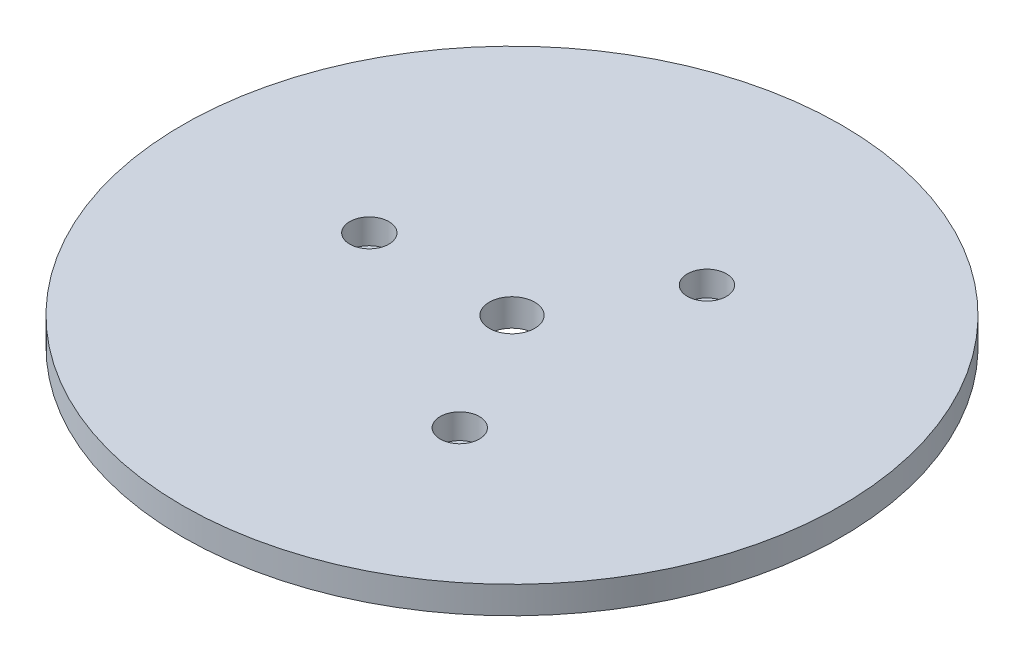
ISO-10303-21;
HEADER;
FILE_DESCRIPTION(('STEP AP214'),'2;1');
FILE_NAME('part.step','',(''),(''),'','','');
FILE_SCHEMA(('AUTOMOTIVE_DESIGN { 1 0 10303 214 1 1 1 1 }'));
ENDSEC;
DATA;
#1=APPLICATION_CONTEXT('core data for automotive mechanical design processes');
#2=APPLICATION_PROTOCOL_DEFINITION('international standard','automotive_design',2000,#1);
#3=PRODUCT_CONTEXT('',#1,'mechanical');
#4=PRODUCT('Part','Part','',(#3));
#5=PRODUCT_RELATED_PRODUCT_CATEGORY('part','',(#4));
#6=PRODUCT_DEFINITION_FORMATION('','',#4);
#7=PRODUCT_DEFINITION_CONTEXT('part definition',#1,'design');
#8=PRODUCT_DEFINITION('design','',#6,#7);
#9=PRODUCT_DEFINITION_SHAPE('','',#8);
#10=(LENGTH_UNIT() NAMED_UNIT(*) SI_UNIT(.MILLI.,.METRE.));
#11=(NAMED_UNIT(*) PLANE_ANGLE_UNIT() SI_UNIT($,.RADIAN.));
#12=(NAMED_UNIT(*) SI_UNIT($,.STERADIAN.) SOLID_ANGLE_UNIT());
#13=UNCERTAINTY_MEASURE_WITH_UNIT(LENGTH_MEASURE(1.E-05),#10,'distance_accuracy_value','');
#14=(GEOMETRIC_REPRESENTATION_CONTEXT(3) GLOBAL_UNCERTAINTY_ASSIGNED_CONTEXT((#13)) GLOBAL_UNIT_ASSIGNED_CONTEXT((#10,
#11,#12)) REPRESENTATION_CONTEXT('',''));
#15=CARTESIAN_POINT('',(0.,0.,0.));
#16=DIRECTION('',(0.,0.,1.));
#17=DIRECTION('',(1.,0.,0.));
#18=AXIS2_PLACEMENT_3D('',#15,#16,#17);
#19=CARTESIAN_POINT('',(0.,6.,0.));
#20=DIRECTION('',(0.,-1.,0.));
#21=DIRECTION('',(0.,0.,-1.));
#22=AXIS2_PLACEMENT_3D('',#19,#20,#21);
#23=CYLINDRICAL_SURFACE('',#22,72.5);
#24=CARTESIAN_POINT('',(0.,6.,0.));
#25=DIRECTION('',(0.,1.,0.));
#26=DIRECTION('',(0.,0.,1.));
#27=AXIS2_PLACEMENT_3D('',#24,#25,#26);
#28=CIRCLE('',#27,72.5);
#29=CARTESIAN_POINT('',(0.,6.,72.5));
#30=VERTEX_POINT('',#29);
#31=EDGE_CURVE('E10',#30,#30,#28,.T.);
#32=ORIENTED_EDGE('',*,*,#31,.F.);
#33=EDGE_LOOP('',(#32));
#34=FACE_BOUND('',#33,.T.);
#35=CARTESIAN_POINT('',(0.,0.,0.));
#36=DIRECTION('',(0.,1.,0.));
#37=DIRECTION('',(0.,0.,1.));
#38=AXIS2_PLACEMENT_3D('',#35,#36,#37);
#39=CIRCLE('',#38,72.5);
#40=CARTESIAN_POINT('',(0.,0.,72.5));
#41=VERTEX_POINT('',#40);
#42=EDGE_CURVE('E37',#41,#41,#39,.T.);
#43=ORIENTED_EDGE('',*,*,#42,.T.);
#44=EDGE_LOOP('',(#43));
#45=FACE_BOUND('',#44,.T.);
#46=ADVANCED_FACE('F40',(#34,#45),#23,.T.);
#47=CARTESIAN_POINT('',(0.,6.,0.));
#48=DIRECTION('',(0.,1.,0.));
#49=DIRECTION('',(0.,0.,1.));
#50=AXIS2_PLACEMENT_3D('',#47,#48,#49);
#51=PLANE('',#50);
#52=CARTESIAN_POINT('',(15.6957823254746,6.,27.1858924522633));
#53=DIRECTION('',(0.,1.,0.));
#54=DIRECTION('',(0.866025403784436,0.,-0.500000000000004));
#55=AXIS2_PLACEMENT_3D('',#52,#53,#54);
#56=CIRCLE('',#55,4.30834410628104);
#57=CARTESIAN_POINT('',(19.4269177697589,6.,25.0317203991227));
#58=VERTEX_POINT('',#57);
#59=EDGE_CURVE('E70',#58,#58,#56,.T.);
#60=ORIENTED_EDGE('',*,*,#59,.F.);
#61=EDGE_LOOP('',(#60));
#62=FACE_BOUND('',#61,.T.);
#63=CARTESIAN_POINT('',(15.6957823254742,6.,-27.1858924522635));
#64=DIRECTION('',(0.,1.,0.));
#65=DIRECTION('',(-0.866025403784443,0.,-0.499999999999992));
#66=AXIS2_PLACEMENT_3D('',#63,#64,#65);
#67=CIRCLE('',#66,4.30834410628104);
#68=CARTESIAN_POINT('',(11.9646468811898,6.,-29.340064505404));
#69=VERTEX_POINT('',#68);
#70=EDGE_CURVE('E61',#69,#69,#67,.T.);
#71=ORIENTED_EDGE('',*,*,#70,.F.);
#72=EDGE_LOOP('',(#71));
#73=FACE_BOUND('',#72,.T.);
#74=CARTESIAN_POINT('',(-31.3915646509489,6.,0.));
#75=DIRECTION('',(0.,1.,0.));
#76=DIRECTION('',(0.,0.,1.));
#77=AXIS2_PLACEMENT_3D('',#74,#75,#76);
#78=CIRCLE('',#77,4.30834410628104);
#79=CARTESIAN_POINT('',(-31.3915646509489,6.,4.30834410628104));
#80=VERTEX_POINT('',#79);
#81=EDGE_CURVE('E54',#80,#80,#78,.T.);
#82=ORIENTED_EDGE('',*,*,#81,.F.);
#83=EDGE_LOOP('',(#82));
#84=FACE_BOUND('',#83,.T.);
#85=CARTESIAN_POINT('',(0.,6.,0.));
#86=DIRECTION('',(0.,1.,0.));
#87=DIRECTION('',(0.,0.,1.));
#88=AXIS2_PLACEMENT_3D('',#85,#86,#87);
#89=CIRCLE('',#88,5.);
#90=CARTESIAN_POINT('',(0.,6.,5.));
#91=VERTEX_POINT('',#90);
#92=EDGE_CURVE('E50',#91,#91,#89,.T.);
#93=ORIENTED_EDGE('',*,*,#92,.F.);
#94=EDGE_LOOP('',(#93));
#95=FACE_BOUND('',#94,.T.);
#96=ORIENTED_EDGE('',*,*,#31,.T.);
#97=EDGE_LOOP('',(#96));
#98=FACE_BOUND('',#97,.T.);
#99=ADVANCED_FACE('F85',(#62,#73,#84,#95,#98),#51,.T.);
#100=CARTESIAN_POINT('',(0.,0.,0.));
#101=DIRECTION('',(0.,1.,0.));
#102=DIRECTION('',(0.,0.,1.));
#103=AXIS2_PLACEMENT_3D('',#100,#101,#102);
#104=PLANE('',#103);
#105=CARTESIAN_POINT('',(0.,0.,0.));
#106=DIRECTION('',(0.,1.,0.));
#107=DIRECTION('',(0.,0.,1.));
#108=AXIS2_PLACEMENT_3D('',#105,#106,#107);
#109=CIRCLE('',#108,5.);
#110=CARTESIAN_POINT('',(0.,0.,5.));
#111=VERTEX_POINT('',#110);
#112=EDGE_CURVE('E47',#111,#111,#109,.T.);
#113=ORIENTED_EDGE('',*,*,#112,.T.);
#114=EDGE_LOOP('',(#113));
#115=FACE_BOUND('',#114,.T.);
#116=ORIENTED_EDGE('',*,*,#42,.F.);
#117=EDGE_LOOP('',(#116));
#118=FACE_BOUND('',#117,.T.);
#119=ADVANCED_FACE('F84',(#115,#118),#104,.F.);
#120=CARTESIAN_POINT('',(0.,6.,0.));
#121=DIRECTION('',(0.,-1.,0.));
#122=DIRECTION('',(0.,0.,-1.));
#123=AXIS2_PLACEMENT_3D('',#120,#121,#122);
#124=CYLINDRICAL_SURFACE('',#123,5.);
#125=ORIENTED_EDGE('',*,*,#92,.T.);
#126=EDGE_LOOP('',(#125));
#127=FACE_BOUND('',#126,.T.);
#128=ORIENTED_EDGE('',*,*,#112,.F.);
#129=EDGE_LOOP('',(#128));
#130=FACE_BOUND('',#129,.T.);
#131=ADVANCED_FACE('F91',(#127,#130),#124,.F.);
#132=CARTESIAN_POINT('',(-31.3915646509489,0.508905277982088,0.));
#133=DIRECTION('',(0.,1.,0.));
#134=DIRECTION('',(0.,0.,1.));
#135=AXIS2_PLACEMENT_3D('',#132,#133,#134);
#136=CYLINDRICAL_SURFACE('',#135,4.30834410628104);
#137=CARTESIAN_POINT('',(-31.3915646509489,0.508905277982088,0.));
#138=DIRECTION('',(0.,1.,0.));
#139=DIRECTION('',(0.,0.,1.));
#140=AXIS2_PLACEMENT_3D('',#137,#138,#139);
#141=CIRCLE('',#140,4.30834410628104);
#142=CARTESIAN_POINT('',(-31.3915646509489,0.508905277982088,4.30834410628104));
#143=VERTEX_POINT('',#142);
#144=EDGE_CURVE('E55',#143,#143,#141,.T.);
#145=ORIENTED_EDGE('',*,*,#144,.F.);
#146=EDGE_LOOP('',(#145));
#147=FACE_BOUND('',#146,.T.);
#148=ORIENTED_EDGE('',*,*,#81,.T.);
#149=EDGE_LOOP('',(#148));
#150=FACE_BOUND('',#149,.T.);
#151=ADVANCED_FACE('F96',(#147,#150),#136,.F.);
#152=CARTESIAN_POINT('',(-31.3915646509489,0.508905277982088,0.));
#153=DIRECTION('',(0.,1.,0.));
#154=DIRECTION('',(0.,0.,1.));
#155=AXIS2_PLACEMENT_3D('',#152,#153,#154);
#156=PLANE('',#155);
#157=ORIENTED_EDGE('',*,*,#144,.T.);
#158=EDGE_LOOP('',(#157));
#159=FACE_BOUND('',#158,.T.);
#160=ADVANCED_FACE('F127',(#159),#156,.T.);
#161=CARTESIAN_POINT('',(15.6957823254742,0.508905277982088,-27.1858924522635));
#162=DIRECTION('',(0.,1.,0.));
#163=DIRECTION('',(0.,0.,1.));
#164=AXIS2_PLACEMENT_3D('',#161,#162,#163);
#165=CYLINDRICAL_SURFACE('',#164,4.30834410628104);
#166=CARTESIAN_POINT('',(15.6957823254742,0.508905277982088,-27.1858924522635));
#167=DIRECTION('',(0.,1.,0.));
#168=DIRECTION('',(-0.866025403784443,0.,-0.499999999999992));
#169=AXIS2_PLACEMENT_3D('',#166,#167,#168);
#170=CIRCLE('',#169,4.30834410628104);
#171=CARTESIAN_POINT('',(11.9646468811898,0.508905277982088,-29.340064505404));
#172=VERTEX_POINT('',#171);
#173=EDGE_CURVE('E63',#172,#172,#170,.T.);
#174=ORIENTED_EDGE('',*,*,#173,.F.);
#175=EDGE_LOOP('',(#174));
#176=FACE_BOUND('',#175,.T.);
#177=ORIENTED_EDGE('',*,*,#70,.T.);
#178=EDGE_LOOP('',(#177));
#179=FACE_BOUND('',#178,.T.);
#180=ADVANCED_FACE('F133',(#176,#179),#165,.F.);
#181=CARTESIAN_POINT('',(15.6957823254742,0.508905277982088,-27.1858924522635));
#182=DIRECTION('',(0.,1.,0.));
#183=DIRECTION('',(-0.866025403784443,0.,-0.499999999999992));
#184=AXIS2_PLACEMENT_3D('',#181,#182,#183);
#185=PLANE('',#184);
#186=ORIENTED_EDGE('',*,*,#173,.T.);
#187=EDGE_LOOP('',(#186));
#188=FACE_BOUND('',#187,.T.);
#189=ADVANCED_FACE('F77',(#188),#185,.T.);
#190=CARTESIAN_POINT('',(15.6957823254746,0.508905277982088,27.1858924522633));
#191=DIRECTION('',(0.,1.,0.));
#192=DIRECTION('',(0.,0.,1.));
#193=AXIS2_PLACEMENT_3D('',#190,#191,#192);
#194=CYLINDRICAL_SURFACE('',#193,4.30834410628104);
#195=CARTESIAN_POINT('',(15.6957823254746,0.508905277982088,27.1858924522633));
#196=DIRECTION('',(0.,1.,0.));
#197=DIRECTION('',(0.866025403784436,0.,-0.500000000000004));
#198=AXIS2_PLACEMENT_3D('',#195,#196,#197);
#199=CIRCLE('',#198,4.30834410628104);
#200=CARTESIAN_POINT('',(19.4269177697589,0.508905277982088,25.0317203991227));
#201=VERTEX_POINT('',#200);
#202=EDGE_CURVE('E59',#201,#201,#199,.T.);
#203=ORIENTED_EDGE('',*,*,#202,.F.);
#204=EDGE_LOOP('',(#203));
#205=FACE_BOUND('',#204,.T.);
#206=ORIENTED_EDGE('',*,*,#59,.T.);
#207=EDGE_LOOP('',(#206));
#208=FACE_BOUND('',#207,.T.);
#209=ADVANCED_FACE('F73',(#205,#208),#194,.F.);
#210=CARTESIAN_POINT('',(15.6957823254746,0.508905277982088,27.1858924522633));
#211=DIRECTION('',(0.,1.,0.));
#212=DIRECTION('',(0.866025403784436,0.,-0.500000000000004));
#213=AXIS2_PLACEMENT_3D('',#210,#211,#212);
#214=PLANE('',#213);
#215=ORIENTED_EDGE('',*,*,#202,.T.);
#216=EDGE_LOOP('',(#215));
#217=FACE_BOUND('',#216,.T.);
#218=ADVANCED_FACE('F71',(#217),#214,.T.);
#219=CLOSED_SHELL('',(#46,#99,#119,#131,#151,#160,#180,#189,#209,#218));
#220=MANIFOLD_SOLID_BREP('B2',#219);
#221=ADVANCED_BREP_SHAPE_REPRESENTATION('',(#18,#220),#14);
#222=SHAPE_DEFINITION_REPRESENTATION(#9,#221);
ENDSEC;
END-ISO-10303-21;
